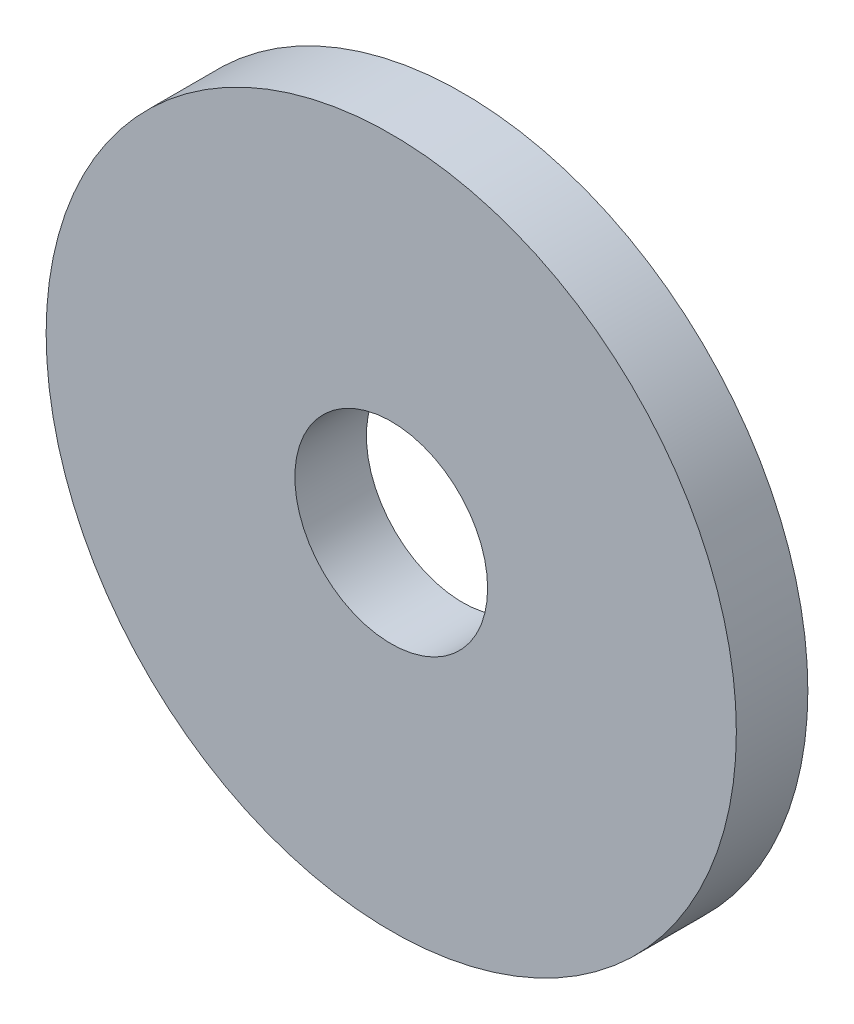
ISO-10303-21;
HEADER;
FILE_DESCRIPTION(('STEP AP214'),'2;1');
FILE_NAME('part.step','',(''),(''),'','','');
FILE_SCHEMA(('AUTOMOTIVE_DESIGN { 1 0 10303 214 1 1 1 1 }'));
ENDSEC;
DATA;
#1=APPLICATION_CONTEXT('core data for automotive mechanical design processes');
#2=APPLICATION_PROTOCOL_DEFINITION('international standard','automotive_design',2000,#1);
#3=PRODUCT_CONTEXT('',#1,'mechanical');
#4=PRODUCT('Part','Part','',(#3));
#5=PRODUCT_RELATED_PRODUCT_CATEGORY('part','',(#4));
#6=PRODUCT_DEFINITION_FORMATION('','',#4);
#7=PRODUCT_DEFINITION_CONTEXT('part definition',#1,'design');
#8=PRODUCT_DEFINITION('design','',#6,#7);
#9=PRODUCT_DEFINITION_SHAPE('','',#8);
#10=(LENGTH_UNIT() NAMED_UNIT(*) SI_UNIT(.MILLI.,.METRE.));
#11=(NAMED_UNIT(*) PLANE_ANGLE_UNIT() SI_UNIT($,.RADIAN.));
#12=(NAMED_UNIT(*) SI_UNIT($,.STERADIAN.) SOLID_ANGLE_UNIT());
#13=UNCERTAINTY_MEASURE_WITH_UNIT(LENGTH_MEASURE(1.E-05),#10,'distance_accuracy_value','');
#14=(GEOMETRIC_REPRESENTATION_CONTEXT(3) GLOBAL_UNCERTAINTY_ASSIGNED_CONTEXT((#13)) GLOBAL_UNIT_ASSIGNED_CONTEXT((#10,
#11,#12)) REPRESENTATION_CONTEXT('',''));
#15=CARTESIAN_POINT('',(0.,0.,0.));
#16=DIRECTION('',(0.,0.,1.));
#17=DIRECTION('',(1.,0.,0.));
#18=AXIS2_PLACEMENT_3D('',#15,#16,#17);
#19=CARTESIAN_POINT('',(0.,0.,1.15));
#20=DIRECTION('',(0.,0.,1.));
#21=DIRECTION('',(1.,0.,0.));
#22=AXIS2_PLACEMENT_3D('',#19,#20,#21);
#23=PLANE('',#22);
#24=CARTESIAN_POINT('',(0.,0.,1.15));
#25=DIRECTION('',(0.,0.,1.));
#26=DIRECTION('',(1.,0.,0.));
#27=AXIS2_PLACEMENT_3D('',#24,#25,#26);
#28=CIRCLE('',#27,5.55);
#29=CARTESIAN_POINT('',(5.55,0.,1.15));
#30=VERTEX_POINT('',#29);
#31=EDGE_CURVE('E9',#30,#30,#28,.T.);
#32=ORIENTED_EDGE('',*,*,#31,.T.);
#33=EDGE_LOOP('',(#32));
#34=FACE_BOUND('',#33,.T.);
#35=CARTESIAN_POINT('',(0.,0.,1.15));
#36=DIRECTION('',(0.,0.,1.));
#37=DIRECTION('',(1.,0.,0.));
#38=AXIS2_PLACEMENT_3D('',#35,#36,#37);
#39=CIRCLE('',#38,1.55);
#40=CARTESIAN_POINT('',(1.55,0.,1.15));
#41=VERTEX_POINT('',#40);
#42=EDGE_CURVE('E25',#41,#41,#39,.T.);
#43=ORIENTED_EDGE('',*,*,#42,.F.);
#44=EDGE_LOOP('',(#43));
#45=FACE_BOUND('',#44,.T.);
#46=ADVANCED_FACE('F14',(#34,#45),#23,.T.);
#47=CARTESIAN_POINT('',(0.,0.,0.));
#48=DIRECTION('',(0.,0.,1.));
#49=DIRECTION('',(1.,0.,0.));
#50=AXIS2_PLACEMENT_3D('',#47,#48,#49);
#51=PLANE('',#50);
#52=CARTESIAN_POINT('',(0.,0.,0.));
#53=DIRECTION('',(0.,0.,1.));
#54=DIRECTION('',(1.,0.,0.));
#55=AXIS2_PLACEMENT_3D('',#52,#53,#54);
#56=CIRCLE('',#55,5.55);
#57=CARTESIAN_POINT('',(5.55,0.,0.));
#58=VERTEX_POINT('',#57);
#59=EDGE_CURVE('E18',#58,#58,#56,.T.);
#60=ORIENTED_EDGE('',*,*,#59,.F.);
#61=EDGE_LOOP('',(#60));
#62=FACE_BOUND('',#61,.T.);
#63=CARTESIAN_POINT('',(0.,0.,0.));
#64=DIRECTION('',(0.,0.,1.));
#65=DIRECTION('',(1.,0.,0.));
#66=AXIS2_PLACEMENT_3D('',#63,#64,#65);
#67=CIRCLE('',#66,1.55);
#68=CARTESIAN_POINT('',(1.55,0.,0.));
#69=VERTEX_POINT('',#68);
#70=EDGE_CURVE('E27',#69,#69,#67,.T.);
#71=ORIENTED_EDGE('',*,*,#70,.T.);
#72=EDGE_LOOP('',(#71));
#73=FACE_BOUND('',#72,.T.);
#74=ADVANCED_FACE('F37',(#62,#73),#51,.F.);
#75=CARTESIAN_POINT('',(0.,0.,1.15));
#76=DIRECTION('',(0.,0.,-1.));
#77=DIRECTION('',(-1.,0.,0.));
#78=AXIS2_PLACEMENT_3D('',#75,#76,#77);
#79=CYLINDRICAL_SURFACE('',#78,5.55);
#80=ORIENTED_EDGE('',*,*,#31,.F.);
#81=EDGE_LOOP('',(#80));
#82=FACE_BOUND('',#81,.T.);
#83=ORIENTED_EDGE('',*,*,#59,.T.);
#84=EDGE_LOOP('',(#83));
#85=FACE_BOUND('',#84,.T.);
#86=ADVANCED_FACE('F16',(#82,#85),#79,.T.);
#87=CARTESIAN_POINT('',(0.,0.,1.15));
#88=DIRECTION('',(0.,0.,-1.));
#89=DIRECTION('',(-1.,0.,0.));
#90=AXIS2_PLACEMENT_3D('',#87,#88,#89);
#91=CYLINDRICAL_SURFACE('',#90,1.55);
#92=ORIENTED_EDGE('',*,*,#42,.T.);
#93=EDGE_LOOP('',(#92));
#94=FACE_BOUND('',#93,.T.);
#95=ORIENTED_EDGE('',*,*,#70,.F.);
#96=EDGE_LOOP('',(#95));
#97=FACE_BOUND('',#96,.T.);
#98=ADVANCED_FACE('F33',(#94,#97),#91,.F.);
#99=CLOSED_SHELL('',(#46,#74,#86,#98));
#100=MANIFOLD_SOLID_BREP('B1',#99);
#101=ADVANCED_BREP_SHAPE_REPRESENTATION('',(#18,#100),#14);
#102=SHAPE_DEFINITION_REPRESENTATION(#9,#101);
ENDSEC;
END-ISO-10303-21;
